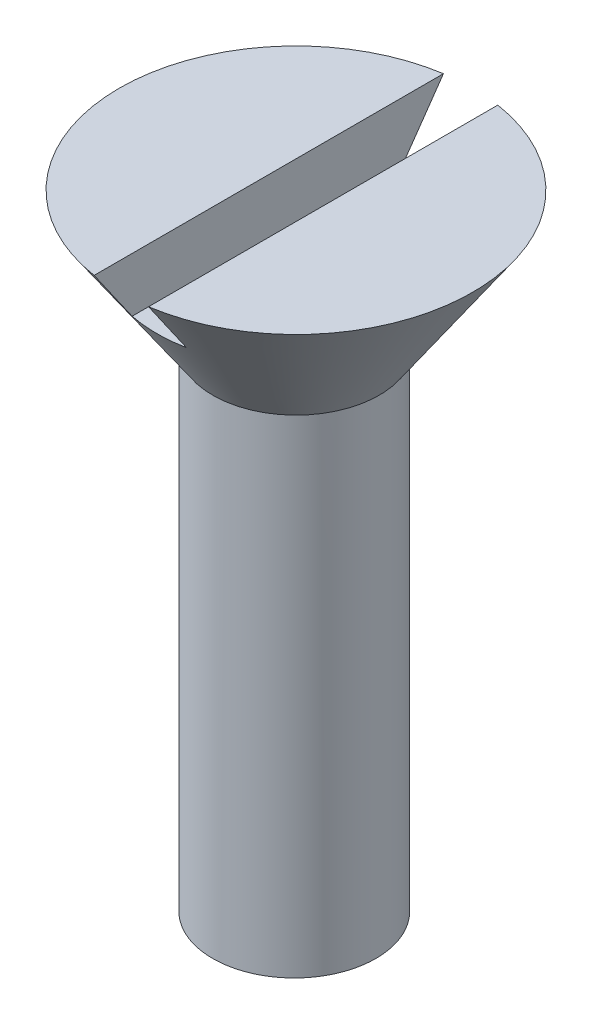
ISO-10303-21;
HEADER;
FILE_DESCRIPTION(('STEP AP214'),'2;1');
FILE_NAME('part.step','',(''),(''),'','','');
FILE_SCHEMA(('AUTOMOTIVE_DESIGN { 1 0 10303 214 1 1 1 1 }'));
ENDSEC;
DATA;
#1=APPLICATION_CONTEXT('core data for automotive mechanical design processes');
#2=APPLICATION_PROTOCOL_DEFINITION('international standard','automotive_design',2000,#1);
#3=PRODUCT_CONTEXT('',#1,'mechanical');
#4=PRODUCT('Part','Part','',(#3));
#5=PRODUCT_RELATED_PRODUCT_CATEGORY('part','',(#4));
#6=PRODUCT_DEFINITION_FORMATION('','',#4);
#7=PRODUCT_DEFINITION_CONTEXT('part definition',#1,'design');
#8=PRODUCT_DEFINITION('design','',#6,#7);
#9=PRODUCT_DEFINITION_SHAPE('','',#8);
#10=(LENGTH_UNIT() NAMED_UNIT(*) SI_UNIT(.MILLI.,.METRE.));
#11=(NAMED_UNIT(*) PLANE_ANGLE_UNIT() SI_UNIT($,.RADIAN.));
#12=(NAMED_UNIT(*) SI_UNIT($,.STERADIAN.) SOLID_ANGLE_UNIT());
#13=UNCERTAINTY_MEASURE_WITH_UNIT(LENGTH_MEASURE(1.E-05),#10,'distance_accuracy_value','');
#14=(GEOMETRIC_REPRESENTATION_CONTEXT(3) GLOBAL_UNCERTAINTY_ASSIGNED_CONTEXT((#13)) GLOBAL_UNIT_ASSIGNED_CONTEXT((#10,
#11,#12)) REPRESENTATION_CONTEXT('',''));
#15=CARTESIAN_POINT('',(0.,0.,0.));
#16=DIRECTION('',(0.,0.,1.));
#17=DIRECTION('',(1.,0.,0.));
#18=AXIS2_PLACEMENT_3D('',#15,#16,#17);
#19=CARTESIAN_POINT('',(0.,14.,0.));
#20=DIRECTION('',(0.,-1.,0.));
#21=DIRECTION('',(1.,0.,0.));
#22=AXIS2_PLACEMENT_3D('',#19,#20,#21);
#23=PLANE('',#22);
#24=CARTESIAN_POINT('',(0.,14.,0.));
#25=DIRECTION('',(0.,1.,0.));
#26=DIRECTION('',(-1.,0.,0.));
#27=AXIS2_PLACEMENT_3D('',#24,#25,#26);
#28=CIRCLE('',#27,6.5);
#29=CARTESIAN_POINT('',(1.,14.,6.42261628933256));
#30=VERTEX_POINT('',#29);
#31=CARTESIAN_POINT('',(1.,14.,-6.42261628933256));
#32=VERTEX_POINT('',#31);
#33=EDGE_CURVE('E122',#30,#32,#28,.T.);
#34=ORIENTED_EDGE('',*,*,#33,.T.);
#35=DIRECTION('',(0.,0.,-1.));
#36=VECTOR('',#35,1.);
#37=CARTESIAN_POINT('',(1.,14.,36.8060796608386));
#38=LINE('',#37,#36);
#39=EDGE_CURVE('E126',#30,#32,#38,.T.);
#40=ORIENTED_EDGE('',*,*,#39,.F.);
#41=EDGE_LOOP('',(#34,#40));
#42=FACE_BOUND('',#41,.T.);
#43=ADVANCED_FACE('F33',(#42),#23,.F.);
#44=CARTESIAN_POINT('',(-0.0622406639004154,9.,0.));
#45=DIRECTION('',(0.,1.,0.));
#46=DIRECTION('',(-1.,0.,0.));
#47=AXIS2_PLACEMENT_3D('',#44,#45,#46);
#48=CYLINDRICAL_SURFACE('',#47,3.);
#49=CARTESIAN_POINT('',(-0.0622406639004132,-9.,0.));
#50=DIRECTION('',(0.,1.,0.));
#51=DIRECTION('',(-1.,0.,0.));
#52=AXIS2_PLACEMENT_3D('',#49,#50,#51);
#53=CIRCLE('',#52,3.);
#54=CARTESIAN_POINT('',(2.93775933609959,-9.,0.));
#55=VERTEX_POINT('',#54);
#56=EDGE_CURVE('E131',#55,#55,#53,.T.);
#57=ORIENTED_EDGE('',*,*,#56,.T.);
#58=EDGE_LOOP('',(#57));
#59=FACE_BOUND('',#58,.T.);
#60=CARTESIAN_POINT('',(-0.0622406639004154,9.,0.));
#61=DIRECTION('',(0.,1.,0.));
#62=DIRECTION('',(-1.,0.,0.));
#63=AXIS2_PLACEMENT_3D('',#60,#61,#62);
#64=CIRCLE('',#63,3.);
#65=CARTESIAN_POINT('',(-3.06224066390041,9.,0.));
#66=VERTEX_POINT('',#65);
#67=EDGE_CURVE('E61',#66,#66,#64,.T.);
#68=ORIENTED_EDGE('',*,*,#67,.F.);
#69=EDGE_LOOP('',(#68));
#70=FACE_BOUND('',#69,.T.);
#71=ADVANCED_FACE('F35',(#59,#70),#48,.T.);
#72=CARTESIAN_POINT('',(-3.06224066390041,-9.,0.));
#73=DIRECTION('',(0.,-1.,0.));
#74=DIRECTION('',(1.,0.,0.));
#75=AXIS2_PLACEMENT_3D('',#72,#73,#74);
#76=PLANE('',#75);
#77=ORIENTED_EDGE('',*,*,#56,.F.);
#78=CARTESIAN_POINT('',(0.,-9.,0.));
#79=DIRECTION('',(0.,-1.,0.));
#80=DIRECTION('',(1.,0.,0.));
#81=AXIS2_PLACEMENT_3D('',#78,#79,#80);
#82=CIRCLE('',#81,2.93775933609959);
#83=EDGE_CURVE('E223',#55,#55,#82,.T.);
#84=ORIENTED_EDGE('',*,*,#83,.F.);
#85=EDGE_LOOP('',(#77,#84));
#86=FACE_BOUND('',#85,.T.);
#87=ADVANCED_FACE('F105',(#86),#76,.T.);
#88=CARTESIAN_POINT('',(-1.,14.,-6.42261628933256));
#89=VERTEX_POINT('',#88);
#90=CARTESIAN_POINT('',(-1.,14.,6.42261628933256));
#91=VERTEX_POINT('',#90);
#92=EDGE_CURVE('E120',#89,#91,#28,.T.);
#93=ORIENTED_EDGE('',*,*,#92,.T.);
#94=DIRECTION('',(0.,0.,-1.));
#95=VECTOR('',#94,1.);
#96=CARTESIAN_POINT('',(-1.,14.,36.8060796608386));
#97=LINE('',#96,#95);
#98=EDGE_CURVE('E55',#91,#89,#97,.T.);
#99=ORIENTED_EDGE('',*,*,#98,.T.);
#100=EDGE_LOOP('',(#93,#99));
#101=FACE_BOUND('',#100,.T.);
#102=ADVANCED_FACE('F101',(#101),#23,.F.);
#103=CARTESIAN_POINT('',(0.,9.,0.));
#104=DIRECTION('',(0.,1.,0.));
#105=DIRECTION('',(-1.,0.,0.));
#106=AXIS2_PLACEMENT_3D('',#103,#104,#105);
#107=CONICAL_SURFACE('',#106,3.06224066390042,0.602322565463317);
#108=CARTESIAN_POINT('',(0.,12.,0.));
#109=DIRECTION('',(0.,-1.,0.));
#110=DIRECTION('',(0.,0.,-1.));
#111=AXIS2_PLACEMENT_3D('',#108,#109,#110);
#112=CIRCLE('',#111,5.12489626556017);
#113=CARTESIAN_POINT('',(-1.,12.,-5.02638654828223));
#114=VERTEX_POINT('',#113);
#115=CARTESIAN_POINT('',(1.,12.,-5.02638654828223));
#116=VERTEX_POINT('',#115);
#117=EDGE_CURVE('E48',#114,#116,#112,.T.);
#118=ORIENTED_EDGE('',*,*,#117,.T.);
#119=CARTESIAN_POINT('',(0.999999999999999,21.8919678627795,11.8841385665747));
#120=CARTESIAN_POINT('',(0.999999999999999,21.351528910469,11.5112379741904));
#121=CARTESIAN_POINT('',(0.999999999999999,20.8111408848257,11.1382635084072));
#122=CARTESIAN_POINT('',(0.999999999999999,19.7305196205378,10.3920859916446));
#123=CARTESIAN_POINT('',(1.,19.1902863824949,10.0188829397938));
#124=CARTESIAN_POINT('',(1.,18.1098049237341,9.27201346461221));
#125=CARTESIAN_POINT('',(1.,17.5695567920185,8.89834691249914));
#126=CARTESIAN_POINT('',(1.,16.4893699100997,8.15057079143852));
#127=CARTESIAN_POINT('',(1.,15.9494311588418,7.77646122401472));
#128=CARTESIAN_POINT('',(1.,14.9067203289249,7.05303276293495));
#129=CARTESIAN_POINT('',(1.,14.4039176376573,6.70375801800141));
#130=CARTESIAN_POINT('',(1.,13.3989483073989,6.00428408083035));
#131=CARTESIAN_POINT('',(1.,12.8967816747348,5.65408487950277));
#132=CARTESIAN_POINT('',(1.,11.8936859447481,4.95227611151222));
#133=CARTESIAN_POINT('',(1.,11.3927564854967,4.60066706341739));
#134=CARTESIAN_POINT('',(1.,10.6429455301782,4.07101937384526));
#135=CARTESIAN_POINT('',(1.,10.3932744049397,3.89409921292793));
#136=CARTESIAN_POINT('',(1.,9.89472805173937,3.53914178708908));
#137=CARTESIAN_POINT('',(1.,9.64585281911054,3.36110452873624));
#138=CARTESIAN_POINT('',(1.,9.30070389303028,3.11235080223775));
#139=CARTESIAN_POINT('',(1.,9.2038953660094,3.04237675754553));
#140=CARTESIAN_POINT('',(1.,9.01051915105869,2.90209631276645));
#141=CARTESIAN_POINT('',(1.,8.913951463972,2.83178991151857));
#142=CARTESIAN_POINT('',(1.,8.62456819451949,2.62018823894446));
#143=CARTESIAN_POINT('',(1.,8.43218829176175,2.47829377776909));
#144=CARTESIAN_POINT('',(1.,8.14287568921301,2.26189428451237));
#145=CARTESIAN_POINT('',(1.,8.04523437814279,2.1883372715329));
#146=CARTESIAN_POINT('',(1.,7.85063202557561,2.04033024369629));
#147=CARTESIAN_POINT('',(1.,7.75367097415595,1.96588024190794));
#148=CARTESIAN_POINT('',(1.,7.56083810735144,1.81589943513321));
#149=CARTESIAN_POINT('',(1.,7.46496477687926,1.740370584955));
#150=CARTESIAN_POINT('',(1.,7.27456757870771,1.58764315183193));
#151=CARTESIAN_POINT('',(1.,7.1800435985523,1.51044470939702));
#152=CARTESIAN_POINT('',(1.,6.99285119681465,1.35348319288725));
#153=CARTESIAN_POINT('',(1.,6.90018619462216,1.27371599075238));
#154=CARTESIAN_POINT('',(1.,6.76350443029158,1.15103749318826));
#155=CARTESIAN_POINT('',(1.,6.71822425791442,1.10953709340876));
#156=CARTESIAN_POINT('',(1.,6.62882136026093,1.02531141652912));
#157=CARTESIAN_POINT('',(1.,6.58469849631239,0.982586287475616));
#158=CARTESIAN_POINT('',(1.,6.49906205610503,0.896575045895936));
#159=CARTESIAN_POINT('',(1.,6.45751146834521,0.85332600298211));
#160=CARTESIAN_POINT('',(1.,6.37651629588616,0.764793031152177));
#161=CARTESIAN_POINT('',(1.,6.3370738925831,0.719507080497101));
#162=CARTESIAN_POINT('',(1.,6.26169116705644,0.626675728949198));
#163=CARTESIAN_POINT('',(1.,6.22572560799085,0.579151037089911));
#164=CARTESIAN_POINT('',(1.,6.15873112515309,0.480778523904121));
#165=CARTESIAN_POINT('',(1.,6.12768970838889,0.429939589496247));
#166=CARTESIAN_POINT('',(1.,6.09031972558504,0.357099310565325));
#167=CARTESIAN_POINT('',(1.,6.0806273830147,0.336825273504975));
#168=CARTESIAN_POINT('',(1.,6.0625807512337,0.295681496607155));
#169=CARTESIAN_POINT('',(1.,6.0542270571482,0.274811496652445));
#170=CARTESIAN_POINT('',(1.,6.03157075160571,0.211434136387848));
#171=CARTESIAN_POINT('',(1.,6.01960681146852,0.168036095602357));
#172=CARTESIAN_POINT('',(1.,6.00373741618939,0.0791755483419465));
#173=CARTESIAN_POINT('',(1.,5.99993194992642,0.0336943274434608));
#174=CARTESIAN_POINT('',(1.,6.00147515493082,-0.057153968630081));
#175=CARTESIAN_POINT('',(1.,6.00683401231839,-0.102520860588245));
#176=CARTESIAN_POINT('',(1.,6.02688082164568,-0.19737933288571));
#177=CARTESIAN_POINT('',(1.,6.0427143164205,-0.246617437742654));
#178=CARTESIAN_POINT('',(1.,6.08185987659658,-0.342008180475918));
#179=CARTESIAN_POINT('',(1.,6.1051916717545,-0.388152285800864));
#180=CARTESIAN_POINT('',(1.,6.16585600550311,-0.493183529453432));
#181=CARTESIAN_POINT('',(1.,6.20522871230491,-0.550861845975307));
#182=CARTESIAN_POINT('',(1.,6.28927581806385,-0.662276726615639));
#183=CARTESIAN_POINT('',(1.,6.33396294953929,-0.716003304005073));
#184=CARTESIAN_POINT('',(1.,6.42696125047521,-0.820949593926536));
#185=CARTESIAN_POINT('',(1.,6.4752983209306,-0.87214608008314));
#186=CARTESIAN_POINT('',(1.,6.57407714107863,-0.97231759740098));
#187=CARTESIAN_POINT('',(1.,6.62451625514365,-1.02129525873858));
#188=CARTESIAN_POINT('',(1.,6.73358831798605,-1.12396485284333));
#189=CARTESIAN_POINT('',(1.,6.7924294482096,-1.17743445554381));
#190=CARTESIAN_POINT('',(1.,6.91144025282884,-1.28287881602925));
#191=CARTESIAN_POINT('',(1.,6.97161008651251,-1.33485339284847));
#192=CARTESIAN_POINT('',(1.,7.15358387368308,-1.48914665287639));
#193=CARTESIAN_POINT('',(1.,7.27680387838785,-1.5897908235353));
#194=CARTESIAN_POINT('',(1.,7.52559306196958,-1.7885502283091));
#195=CARTESIAN_POINT('',(1.,7.65116595567681,-1.88666075687218));
#196=CARTESIAN_POINT('',(1.,7.90365656246566,-2.08106785326156));
#197=CARTESIAN_POINT('',(1.,8.03057393604713,-2.17736486273472));
#198=CARTESIAN_POINT('',(1.,8.28476842771298,-2.36829915152117));
#199=CARTESIAN_POINT('',(1.,8.41204145196828,-2.46294189873219));
#200=CARTESIAN_POINT('',(1.,8.66724780398904,-2.6513486182491));
#201=CARTESIAN_POINT('',(1.,8.7951811724357,-2.74511253538709));
#202=CARTESIAN_POINT('',(1.,9.05140029980208,-2.93188830336222));
#203=CARTESIAN_POINT('',(1.,9.17968558143766,-3.0249008096752));
#204=CARTESIAN_POINT('',(1.,9.43661786169564,-3.21041876472212));
#205=CARTESIAN_POINT('',(1.,9.56526485259196,-3.30292422416392));
#206=CARTESIAN_POINT('',(1.,9.94553241825618,-3.57548711757039));
#207=CARTESIAN_POINT('',(1.,10.197546717332,-3.75499507301656));
#208=CARTESIAN_POINT('',(1.,10.7022633272066,-4.11304162924227));
#209=CARTESIAN_POINT('',(1.,10.9549656407842,-4.29158022609794));
#210=CARTESIAN_POINT('',(1.,11.7137767064644,-4.82621556533403));
#211=CARTESIAN_POINT('',(1.,12.2205804965555,-5.18132538299685));
#212=CARTESIAN_POINT('',(1.,13.2353985457932,-5.89033698183068));
#213=CARTESIAN_POINT('',(1.,13.7434132750177,-6.24423808877951));
#214=CARTESIAN_POINT('',(1.,14.7600242926209,-6.95119437641933));
#215=CARTESIAN_POINT('',(1.,15.2686205758176,-7.30424956456274));
#216=CARTESIAN_POINT('',(1.,16.2865949428645,-8.01010118900281));
#217=CARTESIAN_POINT('',(1.,16.7959733266598,-8.3628971925011));
#218=CARTESIAN_POINT('',(1.,17.8149884502064,-9.06811907871026));
#219=CARTESIAN_POINT('',(1.,18.3246251907195,-9.42054496032048));
#220=CARTESIAN_POINT('',(1.,19.3438043547117,-10.1249428756122));
#221=CARTESIAN_POINT('',(0.999999999999999,19.8533466797689,-10.4769150517225));
#222=CARTESIAN_POINT('',(0.999999999999999,20.8725665812224,-11.180659975255));
#223=CARTESIAN_POINT('',(0.999999999999999,21.3822441571721,-11.5324327233243));
#224=CARTESIAN_POINT('',(0.999999999999999,21.8919678627795,-11.8841385665747));
#225=B_SPLINE_CURVE_WITH_KNOTS('',3,(#119,#120,#121,#122,#123,#124,#125,#126,#127,#128,#129,
#130,#131,#132,#133,#134,#135,#136,#137,#138,#139,#140,#141,#142,#143,#144,#145,#146,#147,#148,
#149,#150,#151,#152,#153,#154,#155,#156,#157,#158,#159,#160,#161,#162,#163,#164,#165,#166,#167,
#168,#169,#170,#171,#172,#173,#174,#175,#176,#177,#178,#179,#180,#181,#182,#183,#184,#185,#186,
#187,#188,#189,#190,#191,#192,#193,#194,#195,#196,#197,#198,#199,#200,#201,#202,#203,#204,#205,
#206,#207,#208,#209,#210,#211,#212,#213,#214,#215,#216,#217,#218,#219,#220,#221,#222,#223,#224),
.UNSPECIFIED.,.F.,.F.,(4,2,2,2,2,2,2,2,2,2,2,2,2,2,2,2,2,2,2,2,2,2,2,2,2,2,2,2,2,2,2,2,2,2,2,2,
2,2,2,2,2,2,2,2,2,2,2,2,2,2,2,2,4),(0.,1.96981273520515,3.93963302723173,5.91028063394134,
7.88092148216011,9.71755634318056,11.5542093313721,13.3902394611911,14.3082398635019,
15.2262348728996,15.5845835966995,15.9429335732486,16.6600616415203,17.0268005822862,
17.3935341623998,17.7596712713808,18.125777685898,18.4925050963205,18.6767526025617,
18.8609779299089,19.0408530947096,19.2209109146462,19.3995442759717,19.5777169183516,
19.6450893914292,19.712491733797,19.846880269994,19.982906650822,20.1190843228794,
20.2733661494054,20.4280572971216,20.6370184696235,20.8464907669969,21.0576222054222,
21.2684964459406,21.5069794625148,21.7454912258695,22.2227105589344,22.7007603351743,
23.1786921457048,23.6545036866087,24.1303448988274,24.6057126503047,25.0810703239499,
26.0092950378084,26.9375235062462,28.7940139134773,30.6514104469672,32.5087905564317,
34.367656212656,36.226527381146,38.084391736117,39.9422500300005),.UNSPECIFIED.);
#226=EDGE_CURVE('E11',#116,#32,#225,.T.);
#227=ORIENTED_EDGE('',*,*,#226,.T.);
#228=ORIENTED_EDGE('',*,*,#33,.F.);
#229=CARTESIAN_POINT('',(1.,12.,5.02638654828223));
#230=VERTEX_POINT('',#229);
#231=EDGE_CURVE('E37',#30,#230,#225,.T.);
#232=ORIENTED_EDGE('',*,*,#231,.T.);
#233=CARTESIAN_POINT('',(-1.,12.,5.02638654828223));
#234=VERTEX_POINT('',#233);
#235=EDGE_CURVE('E139',#230,#234,#112,.T.);
#236=ORIENTED_EDGE('',*,*,#235,.T.);
#237=CARTESIAN_POINT('',(-1.,21.8919678627795,-11.8841385665747));
#238=CARTESIAN_POINT('',(-1.,21.351528910469,-11.5112379741904));
#239=CARTESIAN_POINT('',(-1.,20.8111408848257,-11.1382635084072));
#240=CARTESIAN_POINT('',(-1.,19.7305196205378,-10.3920859916446));
#241=CARTESIAN_POINT('',(-1.,19.1902863824949,-10.0188829397938));
#242=CARTESIAN_POINT('',(-1.,18.1098049237341,-9.27201346461222));
#243=CARTESIAN_POINT('',(-1.,17.5695567920185,-8.89834691249915));
#244=CARTESIAN_POINT('',(-1.,16.4893699100997,-8.15057079143853));
#245=CARTESIAN_POINT('',(-1.,15.9494311588418,-7.77646122401472));
#246=CARTESIAN_POINT('',(-1.,14.9067203289249,-7.05303276293496));
#247=CARTESIAN_POINT('',(-1.,14.4039176376573,-6.70375801800141));
#248=CARTESIAN_POINT('',(-1.,13.3989483073989,-6.00428408083035));
#249=CARTESIAN_POINT('',(-1.,12.8967816747348,-5.65408487950278));
#250=CARTESIAN_POINT('',(-1.,11.8936859447481,-4.95227611151222));
#251=CARTESIAN_POINT('',(-1.,11.3927564854967,-4.60066706341739));
#252=CARTESIAN_POINT('',(-1.,10.6429455301782,-4.07101937384526));
#253=CARTESIAN_POINT('',(-1.,10.3932744049397,-3.89409921292793));
#254=CARTESIAN_POINT('',(-1.,9.89472805173937,-3.53914178708908));
#255=CARTESIAN_POINT('',(-1.,9.64585281911054,-3.36110452873624));
#256=CARTESIAN_POINT('',(-1.,9.30070389303028,-3.11235080223775));
#257=CARTESIAN_POINT('',(-1.,9.2038953660094,-3.04237675754553));
#258=CARTESIAN_POINT('',(-1.,9.01051915105869,-2.90209631276645));
#259=CARTESIAN_POINT('',(-0.999999999999999,8.913951463972,-2.83178991151857));
#260=CARTESIAN_POINT('',(-0.999999999999999,8.62456819451949,-2.62018823894446));
#261=CARTESIAN_POINT('',(-0.999999999999999,8.43218829176175,-2.47829377776908));
#262=CARTESIAN_POINT('',(-0.999999999999999,8.14287568921301,-2.26189428451237));
#263=CARTESIAN_POINT('',(-0.999999999999999,8.04523437814279,-2.1883372715329));
#264=CARTESIAN_POINT('',(-0.999999999999999,7.8506320255756,-2.04033024369629));
#265=CARTESIAN_POINT('',(-0.999999999999999,7.75367097415594,-1.96588024190794));
#266=CARTESIAN_POINT('',(-0.999999999999999,7.56083810735144,-1.81589943513321));
#267=CARTESIAN_POINT('',(-0.999999999999999,7.46496477687926,-1.740370584955));
#268=CARTESIAN_POINT('',(-0.999999999999999,7.27456757870771,-1.58764315183193));
#269=CARTESIAN_POINT('',(-0.999999999999999,7.1800435985523,-1.51044470939702));
#270=CARTESIAN_POINT('',(-0.999999999999999,6.99285119681465,-1.35348319288725));
#271=CARTESIAN_POINT('',(-0.999999999999999,6.90018619462216,-1.27371599075238));
#272=CARTESIAN_POINT('',(-0.999999999999999,6.76350443029158,-1.15103749318826));
#273=CARTESIAN_POINT('',(-0.999999999999999,6.71822425791442,-1.10953709340876));
#274=CARTESIAN_POINT('',(-0.999999999999999,6.62882136026093,-1.02531141652912));
#275=CARTESIAN_POINT('',(-0.999999999999999,6.58469849631239,-0.982586287475617));
#276=CARTESIAN_POINT('',(-0.999999999999999,6.49906205610503,-0.896575045895937));
#277=CARTESIAN_POINT('',(-0.999999999999999,6.45751146834521,-0.853326002982111));
#278=CARTESIAN_POINT('',(-0.999999999999999,6.37651629588616,-0.764793031152177));
#279=CARTESIAN_POINT('',(-0.999999999999999,6.3370738925831,-0.719507080497101));
#280=CARTESIAN_POINT('',(-0.999999999999999,6.26169116705644,-0.626675728949199));
#281=CARTESIAN_POINT('',(-0.999999999999999,6.22572560799085,-0.579151037089912));
#282=CARTESIAN_POINT('',(-0.999999999999999,6.15873112515309,-0.480778523904122));
#283=CARTESIAN_POINT('',(-0.999999999999999,6.12768970838889,-0.429939589496248));
#284=CARTESIAN_POINT('',(-0.999999999999999,6.09031972558504,-0.357099310565326));
#285=CARTESIAN_POINT('',(-0.999999999999999,6.0806273830147,-0.336825273504976));
#286=CARTESIAN_POINT('',(-0.999999999999999,6.0625807512337,-0.295681496607156));
#287=CARTESIAN_POINT('',(-0.999999999999999,6.0542270571482,-0.274811496652445));
#288=CARTESIAN_POINT('',(-0.999999999999999,6.03157075160571,-0.211434136387848));
#289=CARTESIAN_POINT('',(-0.999999999999999,6.01960681146852,-0.168036095602357));
#290=CARTESIAN_POINT('',(-0.999999999999999,6.00373741618939,-0.0791755483419467));
#291=CARTESIAN_POINT('',(-0.999999999999999,5.99993194992641,-0.0336943274434608));
#292=CARTESIAN_POINT('',(-0.999999999999999,6.00147515493082,0.0571539686300812));
#293=CARTESIAN_POINT('',(-0.999999999999999,6.00683401231838,0.102520860588245));
#294=CARTESIAN_POINT('',(-0.999999999999999,6.02688082164568,0.19737933288571));
#295=CARTESIAN_POINT('',(-0.999999999999999,6.0427143164205,0.246617437742654));
#296=CARTESIAN_POINT('',(-0.999999999999999,6.08185987659658,0.342008180475919));
#297=CARTESIAN_POINT('',(-0.999999999999999,6.1051916717545,0.388152285800864));
#298=CARTESIAN_POINT('',(-0.999999999999999,6.16585600550311,0.493183529453433));
#299=CARTESIAN_POINT('',(-0.999999999999999,6.20522871230491,0.550861845975308));
#300=CARTESIAN_POINT('',(-0.999999999999999,6.28927581806385,0.66227672661564));
#301=CARTESIAN_POINT('',(-0.999999999999999,6.33396294953929,0.716003304005074));
#302=CARTESIAN_POINT('',(-0.999999999999999,6.42696125047521,0.820949593926536));
#303=CARTESIAN_POINT('',(-0.999999999999999,6.4752983209306,0.872146080083141));
#304=CARTESIAN_POINT('',(-0.999999999999999,6.57407714107863,0.97231759740098));
#305=CARTESIAN_POINT('',(-0.999999999999999,6.62451625514365,1.02129525873858));
#306=CARTESIAN_POINT('',(-0.999999999999999,6.73358831798605,1.12396485284333));
#307=CARTESIAN_POINT('',(-0.999999999999999,6.7924294482096,1.17743445554381));
#308=CARTESIAN_POINT('',(-0.999999999999999,6.91144025282885,1.28287881602926));
#309=CARTESIAN_POINT('',(-0.999999999999999,6.97161008651251,1.33485339284847));
#310=CARTESIAN_POINT('',(-1.,7.15358387368308,1.48914665287639));
#311=CARTESIAN_POINT('',(-0.999999999999999,7.27680387838785,1.5897908235353));
#312=CARTESIAN_POINT('',(-0.999999999999999,7.52559306196958,1.7885502283091));
#313=CARTESIAN_POINT('',(-0.999999999999999,7.65116595567682,1.88666075687219));
#314=CARTESIAN_POINT('',(-0.999999999999999,7.90365656246566,2.08106785326156));
#315=CARTESIAN_POINT('',(-0.999999999999999,8.03057393604713,2.17736486273473));
#316=CARTESIAN_POINT('',(-0.999999999999999,8.28476842771298,2.36829915152117));
#317=CARTESIAN_POINT('',(-0.999999999999999,8.41204145196828,2.46294189873219));
#318=CARTESIAN_POINT('',(-0.999999999999999,8.66724780398904,2.6513486182491));
#319=CARTESIAN_POINT('',(-0.999999999999999,8.7951811724357,2.74511253538709));
#320=CARTESIAN_POINT('',(-0.999999999999999,9.05140029980208,2.93188830336222));
#321=CARTESIAN_POINT('',(-1.,9.17968558143766,3.0249008096752));
#322=CARTESIAN_POINT('',(-1.,9.43661786169564,3.21041876472212));
#323=CARTESIAN_POINT('',(-1.,9.56526485259196,3.30292422416392));
#324=CARTESIAN_POINT('',(-1.,9.94553241825618,3.57548711757039));
#325=CARTESIAN_POINT('',(-1.,10.197546717332,3.75499507301656));
#326=CARTESIAN_POINT('',(-1.,10.7022633272066,4.11304162924227));
#327=CARTESIAN_POINT('',(-1.,10.9549656407842,4.29158022609793));
#328=CARTESIAN_POINT('',(-1.,11.7137767064644,4.82621556533403));
#329=CARTESIAN_POINT('',(-1.,12.2205804965555,5.18132538299685));
#330=CARTESIAN_POINT('',(-1.,13.2353985457932,5.89033698183068));
#331=CARTESIAN_POINT('',(-1.,13.7434132750177,6.24423808877951));
#332=CARTESIAN_POINT('',(-1.,14.7600242926209,6.95119437641933));
#333=CARTESIAN_POINT('',(-1.,15.2686205758176,7.30424956456274));
#334=CARTESIAN_POINT('',(-1.,16.2865949428645,8.0101011890028));
#335=CARTESIAN_POINT('',(-1.,16.7959733266597,8.3628971925011));
#336=CARTESIAN_POINT('',(-1.,17.8149884502064,9.06811907871026));
#337=CARTESIAN_POINT('',(-1.,18.3246251907195,9.42054496032048));
#338=CARTESIAN_POINT('',(-1.,19.3438043547117,10.1249428756122));
#339=CARTESIAN_POINT('',(-1.,19.8533466797689,10.4769150517225));
#340=CARTESIAN_POINT('',(-1.,20.8725665812224,11.180659975255));
#341=CARTESIAN_POINT('',(-1.,21.3822441571721,11.5324327233243));
#342=CARTESIAN_POINT('',(-1.,21.8919678627795,11.8841385665747));
#343=B_SPLINE_CURVE_WITH_KNOTS('',3,(#237,#238,#239,#240,#241,#242,#243,#244,#245,#246,#247,
#248,#249,#250,#251,#252,#253,#254,#255,#256,#257,#258,#259,#260,#261,#262,#263,#264,#265,#266,
#267,#268,#269,#270,#271,#272,#273,#274,#275,#276,#277,#278,#279,#280,#281,#282,#283,#284,#285,
#286,#287,#288,#289,#290,#291,#292,#293,#294,#295,#296,#297,#298,#299,#300,#301,#302,#303,#304,
#305,#306,#307,#308,#309,#310,#311,#312,#313,#314,#315,#316,#317,#318,#319,#320,#321,#322,#323,
#324,#325,#326,#327,#328,#329,#330,#331,#332,#333,#334,#335,#336,#337,#338,#339,#340,#341,#342),
.UNSPECIFIED.,.F.,.F.,(4,2,2,2,2,2,2,2,2,2,2,2,2,2,2,2,2,2,2,2,2,2,2,2,2,2,2,2,2,2,2,2,2,2,2,2,
2,2,2,2,2,2,2,2,2,2,2,2,2,2,2,2,4),(0.,1.96981273520514,3.93963302723172,5.91028063394133,
7.88092148216009,9.71755634318055,11.5542093313721,13.3902394611911,14.3082398635019,
15.2262348728996,15.5845835966995,15.9429335732486,16.6600616415203,17.0268005822862,
17.3935341623998,17.7596712713808,18.125777685898,18.4925050963205,18.6767526025617,
18.8609779299089,19.0408530947096,19.2209109146462,19.3995442759717,19.5777169183516,
19.6450893914292,19.712491733797,19.846880269994,19.982906650822,20.1190843228794,
20.2733661494054,20.4280572971216,20.6370184696235,20.8464907669969,21.0576222054222,
21.2684964459406,21.5069794625148,21.7454912258695,22.2227105589344,22.7007603351743,
23.1786921457048,23.6545036866087,24.1303448988274,24.6057126503047,25.0810703239499,
26.0092950378084,26.9375235062462,28.7940139134773,30.6514104469672,32.5087905564317,
34.367656212656,36.226527381146,38.084391736117,39.9422500300005),.UNSPECIFIED.);
#344=EDGE_CURVE('E134',#234,#91,#343,.T.);
#345=ORIENTED_EDGE('',*,*,#344,.T.);
#346=ORIENTED_EDGE('',*,*,#92,.F.);
#347=EDGE_CURVE('E140',#89,#114,#343,.T.);
#348=ORIENTED_EDGE('',*,*,#347,.T.);
#349=EDGE_LOOP('',(#118,#227,#228,#232,#236,#345,#346,#348));
#350=FACE_BOUND('',#349,.T.);
#351=CARTESIAN_POINT('',(0.,9.,0.));
#352=DIRECTION('',(0.,1.,0.));
#353=DIRECTION('',(-1.,0.,0.));
#354=AXIS2_PLACEMENT_3D('',#351,#352,#353);
#355=CIRCLE('',#354,3.06224066390042);
#356=EDGE_CURVE('E123',#66,#66,#355,.T.);
#357=ORIENTED_EDGE('',*,*,#356,.T.);
#358=EDGE_LOOP('',(#357));
#359=FACE_BOUND('',#358,.T.);
#360=ADVANCED_FACE('F109',(#350,#359),#107,.T.);
#361=CARTESIAN_POINT('',(3.06224066390042,9.,0.));
#362=DIRECTION('',(0.,1.,0.));
#363=DIRECTION('',(-1.,0.,0.));
#364=AXIS2_PLACEMENT_3D('',#361,#362,#363);
#365=PLANE('',#364);
#366=ORIENTED_EDGE('',*,*,#356,.F.);
#367=ORIENTED_EDGE('',*,*,#67,.T.);
#368=EDGE_LOOP('',(#366,#367));
#369=FACE_BOUND('',#368,.T.);
#370=ADVANCED_FACE('F115',(#369),#365,.F.);
#371=CARTESIAN_POINT('',(1.,14.,36.8060796608386));
#372=DIRECTION('',(1.,0.,0.));
#373=DIRECTION('',(0.,1.,0.));
#374=AXIS2_PLACEMENT_3D('',#371,#372,#373);
#375=PLANE('',#374);
#376=ORIENTED_EDGE('',*,*,#231,.F.);
#377=ORIENTED_EDGE('',*,*,#39,.T.);
#378=ORIENTED_EDGE('',*,*,#226,.F.);
#379=DIRECTION('',(0.,0.,-1.));
#380=VECTOR('',#379,1.);
#381=CARTESIAN_POINT('',(1.,12.,36.8060796608386));
#382=LINE('',#381,#380);
#383=EDGE_CURVE('E213',#230,#116,#382,.T.);
#384=ORIENTED_EDGE('',*,*,#383,.F.);
#385=EDGE_LOOP('',(#376,#377,#378,#384));
#386=FACE_BOUND('',#385,.T.);
#387=ADVANCED_FACE('F146',(#386),#375,.F.);
#388=CARTESIAN_POINT('',(1.,12.,36.8060796608386));
#389=DIRECTION('',(0.,-1.,0.));
#390=DIRECTION('',(0.,0.,-1.));
#391=AXIS2_PLACEMENT_3D('',#388,#389,#390);
#392=PLANE('',#391);
#393=ORIENTED_EDGE('',*,*,#235,.F.);
#394=ORIENTED_EDGE('',*,*,#383,.T.);
#395=ORIENTED_EDGE('',*,*,#117,.F.);
#396=DIRECTION('',(0.,0.,-1.));
#397=VECTOR('',#396,1.);
#398=CARTESIAN_POINT('',(-1.,12.,36.8060796608386));
#399=LINE('',#398,#397);
#400=EDGE_CURVE('E220',#234,#114,#399,.T.);
#401=ORIENTED_EDGE('',*,*,#400,.F.);
#402=EDGE_LOOP('',(#393,#394,#395,#401));
#403=FACE_BOUND('',#402,.T.);
#404=ADVANCED_FACE('F95',(#403),#392,.F.);
#405=CARTESIAN_POINT('',(-1.,12.,36.8060796608386));
#406=DIRECTION('',(-1.,0.,0.));
#407=DIRECTION('',(0.,-1.,0.));
#408=AXIS2_PLACEMENT_3D('',#405,#406,#407);
#409=PLANE('',#408);
#410=ORIENTED_EDGE('',*,*,#347,.F.);
#411=ORIENTED_EDGE('',*,*,#98,.F.);
#412=ORIENTED_EDGE('',*,*,#344,.F.);
#413=ORIENTED_EDGE('',*,*,#400,.T.);
#414=EDGE_LOOP('',(#410,#411,#412,#413));
#415=FACE_BOUND('',#414,.T.);
#416=ADVANCED_FACE('F89',(#415),#409,.F.);
#417=CARTESIAN_POINT('',(0.,-10.6961161435115,0.));
#418=DIRECTION('',(0.,1.,0.));
#419=DIRECTION('',(-1.,0.,0.));
#420=AXIS2_PLACEMENT_3D('',#417,#418,#419);
#421=CONICAL_SURFACE('',#420,0.,1.04719755119659);
#422=ORIENTED_EDGE('',*,*,#83,.T.);
#423=EDGE_LOOP('',(#422));
#424=FACE_BOUND('',#423,.T.);
#425=CARTESIAN_POINT('',(0.,-10.6961161435115,0.));
#426=VERTEX_POINT('',#425);
#427=VERTEX_LOOP('',#426);
#428=FACE_BOUND('',#427,.T.);
#429=ADVANCED_FACE('F87',(#424,#428),#421,.T.);
#430=CLOSED_SHELL('',(#43,#71,#87,#102,#360,#370,#387,#404,#416,#429));
#431=MANIFOLD_SOLID_BREP('B2',#430);
#432=ADVANCED_BREP_SHAPE_REPRESENTATION('',(#18,#431),#14);
#433=SHAPE_DEFINITION_REPRESENTATION(#9,#432);
ENDSEC;
END-ISO-10303-21;
